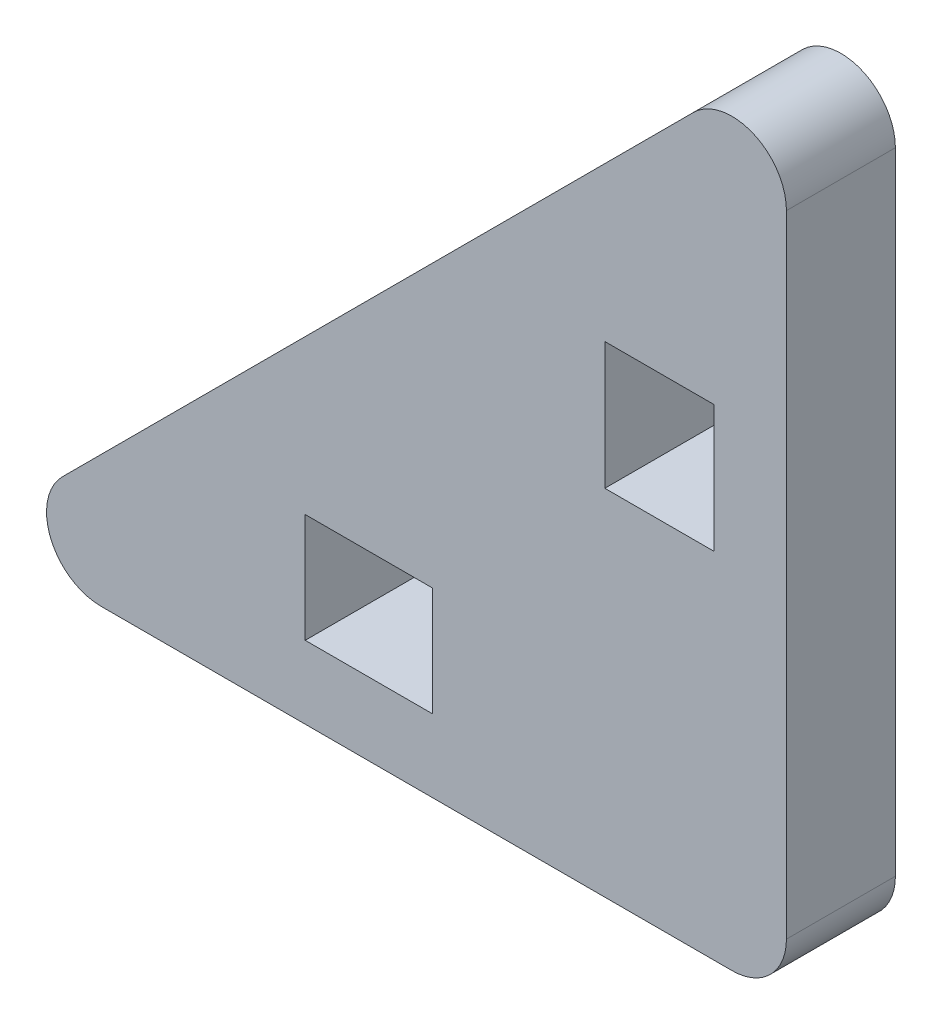
ISO-10303-21;
HEADER;
FILE_DESCRIPTION(('STEP AP214'),'2;1');
FILE_NAME('part.step','',(''),(''),'','','');
FILE_SCHEMA(('AUTOMOTIVE_DESIGN { 1 0 10303 214 1 1 1 1 }'));
ENDSEC;
DATA;
#1=APPLICATION_CONTEXT('core data for automotive mechanical design processes');
#2=APPLICATION_PROTOCOL_DEFINITION('international standard','automotive_design',2000,#1);
#3=PRODUCT_CONTEXT('',#1,'mechanical');
#4=PRODUCT('Part','Part','',(#3));
#5=PRODUCT_RELATED_PRODUCT_CATEGORY('part','',(#4));
#6=PRODUCT_DEFINITION_FORMATION('','',#4);
#7=PRODUCT_DEFINITION_CONTEXT('part definition',#1,'design');
#8=PRODUCT_DEFINITION('design','',#6,#7);
#9=PRODUCT_DEFINITION_SHAPE('','',#8);
#10=(LENGTH_UNIT() NAMED_UNIT(*) SI_UNIT(.MILLI.,.METRE.));
#11=(NAMED_UNIT(*) PLANE_ANGLE_UNIT() SI_UNIT($,.RADIAN.));
#12=(NAMED_UNIT(*) SI_UNIT($,.STERADIAN.) SOLID_ANGLE_UNIT());
#13=UNCERTAINTY_MEASURE_WITH_UNIT(LENGTH_MEASURE(1.E-05),#10,'distance_accuracy_value','');
#14=(GEOMETRIC_REPRESENTATION_CONTEXT(3) GLOBAL_UNCERTAINTY_ASSIGNED_CONTEXT((#13)) GLOBAL_UNIT_ASSIGNED_CONTEXT((#10,
#11,#12)) REPRESENTATION_CONTEXT('',''));
#15=CARTESIAN_POINT('',(0.,0.,0.));
#16=DIRECTION('',(0.,0.,1.));
#17=DIRECTION('',(1.,0.,0.));
#18=AXIS2_PLACEMENT_3D('',#15,#16,#17);
#19=CARTESIAN_POINT('',(0.,0.,3.));
#20=DIRECTION('',(1.,0.,0.));
#21=DIRECTION('',(0.,0.,-1.));
#22=AXIS2_PLACEMENT_3D('',#19,#20,#21);
#23=PLANE('',#22);
#24=DIRECTION('',(0.,-1.,0.));
#25=VECTOR('',#24,1.);
#26=CARTESIAN_POINT('',(0.,0.,3.));
#27=LINE('',#26,#25);
#28=CARTESIAN_POINT('',(0.,18.8713203435596,3.));
#29=VERTEX_POINT('',#28);
#30=CARTESIAN_POINT('',(0.,1.5,3.));
#31=VERTEX_POINT('',#30);
#32=EDGE_CURVE('E183',#29,#31,#27,.T.);
#33=ORIENTED_EDGE('',*,*,#32,.T.);
#34=DIRECTION('',(0.,0.,-1.));
#35=VECTOR('',#34,1.);
#36=CARTESIAN_POINT('',(0.,1.5,3.));
#37=LINE('',#36,#35);
#38=CARTESIAN_POINT('',(0.,1.5,0.));
#39=VERTEX_POINT('',#38);
#40=EDGE_CURVE('E235',#31,#39,#37,.T.);
#41=ORIENTED_EDGE('',*,*,#40,.T.);
#42=DIRECTION('',(0.,-1.,0.));
#43=VECTOR('',#42,1.);
#44=CARTESIAN_POINT('',(0.,0.,0.));
#45=LINE('',#44,#43);
#46=CARTESIAN_POINT('',(0.,18.8713203435596,0.));
#47=VERTEX_POINT('',#46);
#48=EDGE_CURVE('E212',#47,#39,#45,.T.);
#49=ORIENTED_EDGE('',*,*,#48,.F.);
#50=DIRECTION('',(0.,0.,-1.));
#51=VECTOR('',#50,1.);
#52=CARTESIAN_POINT('',(0.,18.8713203435596,3.));
#53=LINE('',#52,#51);
#54=EDGE_CURVE('E228',#47,#29,#53,.F.);
#55=ORIENTED_EDGE('',*,*,#54,.T.);
#56=EDGE_LOOP('',(#33,#41,#49,#55));
#57=FACE_BOUND('',#56,.T.);
#58=ADVANCED_FACE('F41',(#57),#23,.T.);
#59=CARTESIAN_POINT('',(-11.2463203435596,11.2463203435596,3.));
#60=DIRECTION('',(-0.707106781186547,0.707106781186547,0.));
#61=DIRECTION('',(-0.707106781186548,-0.707106781186548,0.));
#62=AXIS2_PLACEMENT_3D('',#59,#60,#61);
#63=PLANE('',#62);
#64=DIRECTION('',(0.707106781186548,0.707106781186548,0.));
#65=VECTOR('',#64,1.);
#66=CARTESIAN_POINT('',(-11.2463203435596,11.2463203435596,0.));
#67=LINE('',#66,#65);
#68=CARTESIAN_POINT('',(-19.9319805153395,2.56066017177982,0.));
#69=VERTEX_POINT('',#68);
#70=CARTESIAN_POINT('',(-2.56066017177982,19.9319805153395,0.));
#71=VERTEX_POINT('',#70);
#72=EDGE_CURVE('E215',#69,#71,#67,.T.);
#73=ORIENTED_EDGE('',*,*,#72,.F.);
#74=DIRECTION('',(0.,0.,-1.));
#75=VECTOR('',#74,1.);
#76=CARTESIAN_POINT('',(-19.9319805153395,2.56066017177982,3.));
#77=LINE('',#76,#75);
#78=CARTESIAN_POINT('',(-19.9319805153395,2.56066017177982,3.));
#79=VERTEX_POINT('',#78);
#80=EDGE_CURVE('E11',#69,#79,#77,.F.);
#81=ORIENTED_EDGE('',*,*,#80,.T.);
#82=DIRECTION('',(0.707106781186548,0.707106781186548,0.));
#83=VECTOR('',#82,1.);
#84=CARTESIAN_POINT('',(-11.2463203435596,11.2463203435596,3.));
#85=LINE('',#84,#83);
#86=CARTESIAN_POINT('',(-2.56066017177982,19.9319805153395,3.));
#87=VERTEX_POINT('',#86);
#88=EDGE_CURVE('E186',#79,#87,#85,.T.);
#89=ORIENTED_EDGE('',*,*,#88,.T.);
#90=DIRECTION('',(0.,0.,-1.));
#91=VECTOR('',#90,1.);
#92=CARTESIAN_POINT('',(-2.56066017177982,19.9319805153395,3.));
#93=LINE('',#92,#91);
#94=EDGE_CURVE('E49',#87,#71,#93,.T.);
#95=ORIENTED_EDGE('',*,*,#94,.T.);
#96=EDGE_LOOP('',(#73,#81,#89,#95));
#97=FACE_BOUND('',#96,.T.);
#98=ADVANCED_FACE('F255',(#97),#63,.T.);
#99=CARTESIAN_POINT('',(-2.,0.,3.));
#100=DIRECTION('',(-1.,0.,0.));
#101=DIRECTION('',(0.,0.,1.));
#102=AXIS2_PLACEMENT_3D('',#99,#100,#101);
#103=PLANE('',#102);
#104=DIRECTION('',(0.,1.,0.));
#105=VECTOR('',#104,1.);
#106=CARTESIAN_POINT('',(-2.,0.,0.));
#107=LINE('',#106,#105);
#108=CARTESIAN_POINT('',(-2.,9.75,0.));
#109=VERTEX_POINT('',#108);
#110=CARTESIAN_POINT('',(-2.,13.25,0.));
#111=VERTEX_POINT('',#110);
#112=EDGE_CURVE('E200',#109,#111,#107,.T.);
#113=ORIENTED_EDGE('',*,*,#112,.F.);
#114=DIRECTION('',(0.,0.,-1.));
#115=VECTOR('',#114,1.);
#116=CARTESIAN_POINT('',(-2.,9.75,3.));
#117=LINE('',#116,#115);
#118=CARTESIAN_POINT('',(-2.,9.75,3.));
#119=VERTEX_POINT('',#118);
#120=EDGE_CURVE('E226',#119,#109,#117,.T.);
#121=ORIENTED_EDGE('',*,*,#120,.F.);
#122=DIRECTION('',(0.,1.,0.));
#123=VECTOR('',#122,1.);
#124=CARTESIAN_POINT('',(-2.,0.,3.));
#125=LINE('',#124,#123);
#126=CARTESIAN_POINT('',(-2.,13.25,3.));
#127=VERTEX_POINT('',#126);
#128=EDGE_CURVE('E172',#119,#127,#125,.T.);
#129=ORIENTED_EDGE('',*,*,#128,.T.);
#130=DIRECTION('',(0.,0.,-1.));
#131=VECTOR('',#130,1.);
#132=CARTESIAN_POINT('',(-2.,13.25,3.));
#133=LINE('',#132,#131);
#134=EDGE_CURVE('E152',#127,#111,#133,.T.);
#135=ORIENTED_EDGE('',*,*,#134,.T.);
#136=EDGE_LOOP('',(#113,#121,#129,#135));
#137=FACE_BOUND('',#136,.T.);
#138=ADVANCED_FACE('F284',(#137),#103,.T.);
#139=CARTESIAN_POINT('',(0.,9.75,3.));
#140=DIRECTION('',(0.,1.,0.));
#141=DIRECTION('',(0.,0.,1.));
#142=AXIS2_PLACEMENT_3D('',#139,#140,#141);
#143=PLANE('',#142);
#144=DIRECTION('',(1.,0.,0.));
#145=VECTOR('',#144,1.);
#146=CARTESIAN_POINT('',(0.,9.75,0.));
#147=LINE('',#146,#145);
#148=CARTESIAN_POINT('',(-5.,9.75,0.));
#149=VERTEX_POINT('',#148);
#150=EDGE_CURVE('E203',#149,#109,#147,.T.);
#151=ORIENTED_EDGE('',*,*,#150,.F.);
#152=DIRECTION('',(0.,0.,-1.));
#153=VECTOR('',#152,1.);
#154=CARTESIAN_POINT('',(-5.,9.75,3.));
#155=LINE('',#154,#153);
#156=CARTESIAN_POINT('',(-5.,9.75,3.));
#157=VERTEX_POINT('',#156);
#158=EDGE_CURVE('E224',#157,#149,#155,.T.);
#159=ORIENTED_EDGE('',*,*,#158,.F.);
#160=DIRECTION('',(1.,0.,0.));
#161=VECTOR('',#160,1.);
#162=CARTESIAN_POINT('',(0.,9.75,3.));
#163=LINE('',#162,#161);
#164=EDGE_CURVE('E175',#157,#119,#163,.T.);
#165=ORIENTED_EDGE('',*,*,#164,.T.);
#166=ORIENTED_EDGE('',*,*,#120,.T.);
#167=EDGE_LOOP('',(#151,#159,#165,#166));
#168=FACE_BOUND('',#167,.T.);
#169=ADVANCED_FACE('F297',(#168),#143,.T.);
#170=CARTESIAN_POINT('',(-5.,0.,3.));
#171=DIRECTION('',(-1.,0.,0.));
#172=DIRECTION('',(0.,0.,1.));
#173=AXIS2_PLACEMENT_3D('',#170,#171,#172);
#174=PLANE('',#173);
#175=DIRECTION('',(0.,1.,0.));
#176=VECTOR('',#175,1.);
#177=CARTESIAN_POINT('',(-5.,0.,0.));
#178=LINE('',#177,#176);
#179=CARTESIAN_POINT('',(-5.,13.25,0.));
#180=VERTEX_POINT('',#179);
#181=EDGE_CURVE('E206',#149,#180,#178,.T.);
#182=ORIENTED_EDGE('',*,*,#181,.T.);
#183=DIRECTION('',(0.,0.,-1.));
#184=VECTOR('',#183,1.);
#185=CARTESIAN_POINT('',(-5.,13.25,3.));
#186=LINE('',#185,#184);
#187=CARTESIAN_POINT('',(-5.,13.25,3.));
#188=VERTEX_POINT('',#187);
#189=EDGE_CURVE('E221',#188,#180,#186,.T.);
#190=ORIENTED_EDGE('',*,*,#189,.F.);
#191=DIRECTION('',(0.,1.,0.));
#192=VECTOR('',#191,1.);
#193=CARTESIAN_POINT('',(-5.,0.,3.));
#194=LINE('',#193,#192);
#195=EDGE_CURVE('E178',#157,#188,#194,.T.);
#196=ORIENTED_EDGE('',*,*,#195,.F.);
#197=ORIENTED_EDGE('',*,*,#158,.T.);
#198=EDGE_LOOP('',(#182,#190,#196,#197));
#199=FACE_BOUND('',#198,.T.);
#200=ADVANCED_FACE('F294',(#199),#174,.F.);
#201=CARTESIAN_POINT('',(-9.75,0.,3.));
#202=DIRECTION('',(-1.,0.,0.));
#203=DIRECTION('',(0.,0.,1.));
#204=AXIS2_PLACEMENT_3D('',#201,#202,#203);
#205=PLANE('',#204);
#206=DIRECTION('',(0.,1.,0.));
#207=VECTOR('',#206,1.);
#208=CARTESIAN_POINT('',(-9.75,0.,0.));
#209=LINE('',#208,#207);
#210=CARTESIAN_POINT('',(-9.75,2.,0.));
#211=VERTEX_POINT('',#210);
#212=CARTESIAN_POINT('',(-9.75,5.,0.));
#213=VERTEX_POINT('',#212);
#214=EDGE_CURVE('E147',#211,#213,#209,.T.);
#215=ORIENTED_EDGE('',*,*,#214,.F.);
#216=DIRECTION('',(0.,0.,-1.));
#217=VECTOR('',#216,1.);
#218=CARTESIAN_POINT('',(-9.75,2.,3.));
#219=LINE('',#218,#217);
#220=CARTESIAN_POINT('',(-9.75,2.,3.));
#221=VERTEX_POINT('',#220);
#222=EDGE_CURVE('E142',#221,#211,#219,.T.);
#223=ORIENTED_EDGE('',*,*,#222,.F.);
#224=DIRECTION('',(0.,1.,0.));
#225=VECTOR('',#224,1.);
#226=CARTESIAN_POINT('',(-9.75,0.,3.));
#227=LINE('',#226,#225);
#228=CARTESIAN_POINT('',(-9.75,5.,3.));
#229=VERTEX_POINT('',#228);
#230=EDGE_CURVE('E145',#221,#229,#227,.T.);
#231=ORIENTED_EDGE('',*,*,#230,.T.);
#232=DIRECTION('',(0.,0.,-1.));
#233=VECTOR('',#232,1.);
#234=CARTESIAN_POINT('',(-9.75,5.,3.));
#235=LINE('',#234,#233);
#236=EDGE_CURVE('E191',#229,#213,#235,.T.);
#237=ORIENTED_EDGE('',*,*,#236,.T.);
#238=EDGE_LOOP('',(#215,#223,#231,#237));
#239=FACE_BOUND('',#238,.T.);
#240=ADVANCED_FACE('F144',(#239),#205,.T.);
#241=CARTESIAN_POINT('',(0.,2.,3.));
#242=DIRECTION('',(0.,1.,0.));
#243=DIRECTION('',(0.,0.,1.));
#244=AXIS2_PLACEMENT_3D('',#241,#242,#243);
#245=PLANE('',#244);
#246=DIRECTION('',(1.,0.,0.));
#247=VECTOR('',#246,1.);
#248=CARTESIAN_POINT('',(0.,2.,0.));
#249=LINE('',#248,#247);
#250=CARTESIAN_POINT('',(-13.25,2.,0.));
#251=VERTEX_POINT('',#250);
#252=EDGE_CURVE('E193',#251,#211,#249,.T.);
#253=ORIENTED_EDGE('',*,*,#252,.F.);
#254=DIRECTION('',(0.,0.,-1.));
#255=VECTOR('',#254,1.);
#256=CARTESIAN_POINT('',(-13.25,2.,3.));
#257=LINE('',#256,#255);
#258=CARTESIAN_POINT('',(-13.25,2.,3.));
#259=VERTEX_POINT('',#258);
#260=EDGE_CURVE('E153',#259,#251,#257,.T.);
#261=ORIENTED_EDGE('',*,*,#260,.F.);
#262=DIRECTION('',(1.,0.,0.));
#263=VECTOR('',#262,1.);
#264=CARTESIAN_POINT('',(0.,2.,3.));
#265=LINE('',#264,#263);
#266=EDGE_CURVE('E159',#259,#221,#265,.T.);
#267=ORIENTED_EDGE('',*,*,#266,.T.);
#268=ORIENTED_EDGE('',*,*,#222,.T.);
#269=EDGE_LOOP('',(#253,#261,#267,#268));
#270=FACE_BOUND('',#269,.T.);
#271=ADVANCED_FACE('F165',(#270),#245,.T.);
#272=CARTESIAN_POINT('',(-13.25,0.,3.));
#273=DIRECTION('',(-1.,0.,0.));
#274=DIRECTION('',(0.,0.,1.));
#275=AXIS2_PLACEMENT_3D('',#272,#273,#274);
#276=PLANE('',#275);
#277=DIRECTION('',(0.,1.,0.));
#278=VECTOR('',#277,1.);
#279=CARTESIAN_POINT('',(-13.25,0.,0.));
#280=LINE('',#279,#278);
#281=CARTESIAN_POINT('',(-13.25,5.,0.));
#282=VERTEX_POINT('',#281);
#283=EDGE_CURVE('E195',#251,#282,#280,.T.);
#284=ORIENTED_EDGE('',*,*,#283,.T.);
#285=DIRECTION('',(0.,0.,-1.));
#286=VECTOR('',#285,1.);
#287=CARTESIAN_POINT('',(-13.25,5.,3.));
#288=LINE('',#287,#286);
#289=CARTESIAN_POINT('',(-13.25,5.,3.));
#290=VERTEX_POINT('',#289);
#291=EDGE_CURVE('E230',#290,#282,#288,.T.);
#292=ORIENTED_EDGE('',*,*,#291,.F.);
#293=DIRECTION('',(0.,1.,0.));
#294=VECTOR('',#293,1.);
#295=CARTESIAN_POINT('',(-13.25,0.,3.));
#296=LINE('',#295,#294);
#297=EDGE_CURVE('E167',#259,#290,#296,.T.);
#298=ORIENTED_EDGE('',*,*,#297,.F.);
#299=ORIENTED_EDGE('',*,*,#260,.T.);
#300=EDGE_LOOP('',(#284,#292,#298,#299));
#301=FACE_BOUND('',#300,.T.);
#302=ADVANCED_FACE('F292',(#301),#276,.F.);
#303=CARTESIAN_POINT('',(0.,13.25,3.));
#304=DIRECTION('',(0.,1.,0.));
#305=DIRECTION('',(0.,0.,1.));
#306=AXIS2_PLACEMENT_3D('',#303,#304,#305);
#307=PLANE('',#306);
#308=DIRECTION('',(1.,0.,0.));
#309=VECTOR('',#308,1.);
#310=CARTESIAN_POINT('',(0.,13.25,0.));
#311=LINE('',#310,#309);
#312=EDGE_CURVE('E209',#180,#111,#311,.T.);
#313=ORIENTED_EDGE('',*,*,#312,.T.);
#314=ORIENTED_EDGE('',*,*,#134,.F.);
#315=DIRECTION('',(1.,0.,0.));
#316=VECTOR('',#315,1.);
#317=CARTESIAN_POINT('',(0.,13.25,3.));
#318=LINE('',#317,#316);
#319=EDGE_CURVE('E181',#188,#127,#318,.T.);
#320=ORIENTED_EDGE('',*,*,#319,.F.);
#321=ORIENTED_EDGE('',*,*,#189,.T.);
#322=EDGE_LOOP('',(#313,#314,#320,#321));
#323=FACE_BOUND('',#322,.T.);
#324=ADVANCED_FACE('F288',(#323),#307,.F.);
#325=CARTESIAN_POINT('',(0.,5.,3.));
#326=DIRECTION('',(0.,1.,0.));
#327=DIRECTION('',(0.,0.,1.));
#328=AXIS2_PLACEMENT_3D('',#325,#326,#327);
#329=PLANE('',#328);
#330=DIRECTION('',(1.,0.,0.));
#331=VECTOR('',#330,1.);
#332=CARTESIAN_POINT('',(0.,5.,0.));
#333=LINE('',#332,#331);
#334=EDGE_CURVE('E197',#282,#213,#333,.T.);
#335=ORIENTED_EDGE('',*,*,#334,.T.);
#336=ORIENTED_EDGE('',*,*,#236,.F.);
#337=DIRECTION('',(1.,0.,0.));
#338=VECTOR('',#337,1.);
#339=CARTESIAN_POINT('',(0.,5.,3.));
#340=LINE('',#339,#338);
#341=EDGE_CURVE('E161',#290,#229,#340,.T.);
#342=ORIENTED_EDGE('',*,*,#341,.F.);
#343=ORIENTED_EDGE('',*,*,#291,.T.);
#344=EDGE_LOOP('',(#335,#336,#342,#343));
#345=FACE_BOUND('',#344,.T.);
#346=ADVANCED_FACE('F291',(#345),#329,.F.);
#347=CARTESIAN_POINT('',(0.,0.,3.));
#348=DIRECTION('',(0.,-1.,0.));
#349=DIRECTION('',(0.,0.,-1.));
#350=AXIS2_PLACEMENT_3D('',#347,#348,#349);
#351=PLANE('',#350);
#352=DIRECTION('',(-1.,0.,0.));
#353=VECTOR('',#352,1.);
#354=CARTESIAN_POINT('',(0.,0.,0.));
#355=LINE('',#354,#353);
#356=CARTESIAN_POINT('',(-1.5,0.,0.));
#357=VERTEX_POINT('',#356);
#358=CARTESIAN_POINT('',(-18.8713203435596,0.,0.));
#359=VERTEX_POINT('',#358);
#360=EDGE_CURVE('E163',#357,#359,#355,.T.);
#361=ORIENTED_EDGE('',*,*,#360,.F.);
#362=DIRECTION('',(0.,0.,-1.));
#363=VECTOR('',#362,1.);
#364=CARTESIAN_POINT('',(-1.5,0.,3.));
#365=LINE('',#364,#363);
#366=CARTESIAN_POINT('',(-1.5,0.,3.));
#367=VERTEX_POINT('',#366);
#368=EDGE_CURVE('E247',#357,#367,#365,.F.);
#369=ORIENTED_EDGE('',*,*,#368,.T.);
#370=DIRECTION('',(-1.,0.,0.));
#371=VECTOR('',#370,1.);
#372=CARTESIAN_POINT('',(0.,0.,3.));
#373=LINE('',#372,#371);
#374=CARTESIAN_POINT('',(-18.8713203435596,0.,3.));
#375=VERTEX_POINT('',#374);
#376=EDGE_CURVE('E188',#367,#375,#373,.T.);
#377=ORIENTED_EDGE('',*,*,#376,.T.);
#378=DIRECTION('',(0.,0.,-1.));
#379=VECTOR('',#378,1.);
#380=CARTESIAN_POINT('',(-18.8713203435596,0.,3.));
#381=LINE('',#380,#379);
#382=EDGE_CURVE('E244',#375,#359,#381,.T.);
#383=ORIENTED_EDGE('',*,*,#382,.T.);
#384=EDGE_LOOP('',(#361,#369,#377,#383));
#385=FACE_BOUND('',#384,.T.);
#386=ADVANCED_FACE('F266',(#385),#351,.T.);
#387=CARTESIAN_POINT('',(0.,0.,3.));
#388=DIRECTION('',(0.,0.,1.));
#389=DIRECTION('',(1.,0.,0.));
#390=AXIS2_PLACEMENT_3D('',#387,#388,#389);
#391=PLANE('',#390);
#392=ORIENTED_EDGE('',*,*,#230,.F.);
#393=ORIENTED_EDGE('',*,*,#266,.F.);
#394=ORIENTED_EDGE('',*,*,#297,.T.);
#395=ORIENTED_EDGE('',*,*,#341,.T.);
#396=EDGE_LOOP('',(#392,#393,#394,#395));
#397=FACE_BOUND('',#396,.T.);
#398=ORIENTED_EDGE('',*,*,#128,.F.);
#399=ORIENTED_EDGE('',*,*,#164,.F.);
#400=ORIENTED_EDGE('',*,*,#195,.T.);
#401=ORIENTED_EDGE('',*,*,#319,.T.);
#402=EDGE_LOOP('',(#398,#399,#400,#401));
#403=FACE_BOUND('',#402,.T.);
#404=ORIENTED_EDGE('',*,*,#376,.F.);
#405=CARTESIAN_POINT('',(-1.5,1.5,3.));
#406=DIRECTION('',(0.,0.,1.));
#407=DIRECTION('',(1.,0.,0.));
#408=AXIS2_PLACEMENT_3D('',#405,#406,#407);
#409=CIRCLE('',#408,1.5);
#410=EDGE_CURVE('E252',#367,#31,#409,.T.);
#411=ORIENTED_EDGE('',*,*,#410,.T.);
#412=ORIENTED_EDGE('',*,*,#32,.F.);
#413=CARTESIAN_POINT('',(-1.5,18.8713203435596,3.));
#414=DIRECTION('',(0.,0.,1.));
#415=DIRECTION('',(1.,0.,0.));
#416=AXIS2_PLACEMENT_3D('',#413,#414,#415);
#417=CIRCLE('',#416,1.5);
#418=EDGE_CURVE('E56',#29,#87,#417,.T.);
#419=ORIENTED_EDGE('',*,*,#418,.T.);
#420=ORIENTED_EDGE('',*,*,#88,.F.);
#421=CARTESIAN_POINT('',(-18.8713203435596,1.5,3.));
#422=DIRECTION('',(0.,0.,1.));
#423=DIRECTION('',(1.,0.,0.));
#424=AXIS2_PLACEMENT_3D('',#421,#422,#423);
#425=CIRCLE('',#424,1.5);
#426=EDGE_CURVE('E250',#79,#375,#425,.T.);
#427=ORIENTED_EDGE('',*,*,#426,.T.);
#428=EDGE_LOOP('',(#404,#411,#412,#419,#420,#427));
#429=FACE_BOUND('',#428,.T.);
#430=ADVANCED_FACE('F157',(#397,#403,#429),#391,.T.);
#431=CARTESIAN_POINT('',(0.,0.,0.));
#432=DIRECTION('',(0.,0.,1.));
#433=DIRECTION('',(1.,0.,0.));
#434=AXIS2_PLACEMENT_3D('',#431,#432,#433);
#435=PLANE('',#434);
#436=ORIENTED_EDGE('',*,*,#214,.T.);
#437=ORIENTED_EDGE('',*,*,#334,.F.);
#438=ORIENTED_EDGE('',*,*,#283,.F.);
#439=ORIENTED_EDGE('',*,*,#252,.T.);
#440=EDGE_LOOP('',(#436,#437,#438,#439));
#441=FACE_BOUND('',#440,.T.);
#442=ORIENTED_EDGE('',*,*,#112,.T.);
#443=ORIENTED_EDGE('',*,*,#312,.F.);
#444=ORIENTED_EDGE('',*,*,#181,.F.);
#445=ORIENTED_EDGE('',*,*,#150,.T.);
#446=EDGE_LOOP('',(#442,#443,#444,#445));
#447=FACE_BOUND('',#446,.T.);
#448=ORIENTED_EDGE('',*,*,#48,.T.);
#449=CARTESIAN_POINT('',(-1.5,1.5,0.));
#450=DIRECTION('',(0.,0.,1.));
#451=DIRECTION('',(1.,0.,0.));
#452=AXIS2_PLACEMENT_3D('',#449,#450,#451);
#453=CIRCLE('',#452,1.5);
#454=EDGE_CURVE('E242',#39,#357,#453,.F.);
#455=ORIENTED_EDGE('',*,*,#454,.T.);
#456=ORIENTED_EDGE('',*,*,#360,.T.);
#457=CARTESIAN_POINT('',(-18.8713203435596,1.5,0.));
#458=DIRECTION('',(0.,0.,1.));
#459=DIRECTION('',(1.,0.,0.));
#460=AXIS2_PLACEMENT_3D('',#457,#458,#459);
#461=CIRCLE('',#460,1.5);
#462=EDGE_CURVE('E240',#359,#69,#461,.F.);
#463=ORIENTED_EDGE('',*,*,#462,.T.);
#464=ORIENTED_EDGE('',*,*,#72,.T.);
#465=CARTESIAN_POINT('',(-1.5,18.8713203435596,0.));
#466=DIRECTION('',(0.,0.,1.));
#467=DIRECTION('',(1.,0.,0.));
#468=AXIS2_PLACEMENT_3D('',#465,#466,#467);
#469=CIRCLE('',#468,1.5);
#470=EDGE_CURVE('E238',#71,#47,#469,.F.);
#471=ORIENTED_EDGE('',*,*,#470,.T.);
#472=EDGE_LOOP('',(#448,#455,#456,#463,#464,#471));
#473=FACE_BOUND('',#472,.T.);
#474=ADVANCED_FACE('F258',(#441,#447,#473),#435,.F.);
#475=CARTESIAN_POINT('',(-1.5,1.5,3.));
#476=DIRECTION('',(0.,0.,-1.));
#477=DIRECTION('',(-1.,0.,0.));
#478=AXIS2_PLACEMENT_3D('',#475,#476,#477);
#479=CYLINDRICAL_SURFACE('',#478,1.5);
#480=ORIENTED_EDGE('',*,*,#410,.F.);
#481=ORIENTED_EDGE('',*,*,#368,.F.);
#482=ORIENTED_EDGE('',*,*,#454,.F.);
#483=ORIENTED_EDGE('',*,*,#40,.F.);
#484=EDGE_LOOP('',(#480,#481,#482,#483));
#485=FACE_BOUND('',#484,.T.);
#486=ADVANCED_FACE('F272',(#485),#479,.T.);
#487=CARTESIAN_POINT('',(-18.8713203435596,1.5,3.));
#488=DIRECTION('',(0.,0.,-1.));
#489=DIRECTION('',(-1.,0.,0.));
#490=AXIS2_PLACEMENT_3D('',#487,#488,#489);
#491=CYLINDRICAL_SURFACE('',#490,1.5);
#492=ORIENTED_EDGE('',*,*,#426,.F.);
#493=ORIENTED_EDGE('',*,*,#80,.F.);
#494=ORIENTED_EDGE('',*,*,#462,.F.);
#495=ORIENTED_EDGE('',*,*,#382,.F.);
#496=EDGE_LOOP('',(#492,#493,#494,#495));
#497=FACE_BOUND('',#496,.T.);
#498=ADVANCED_FACE('F264',(#497),#491,.T.);
#499=CARTESIAN_POINT('',(-1.5,18.8713203435596,3.));
#500=DIRECTION('',(0.,0.,-1.));
#501=DIRECTION('',(-1.,0.,0.));
#502=AXIS2_PLACEMENT_3D('',#499,#500,#501);
#503=CYLINDRICAL_SURFACE('',#502,1.5);
#504=ORIENTED_EDGE('',*,*,#418,.F.);
#505=ORIENTED_EDGE('',*,*,#54,.F.);
#506=ORIENTED_EDGE('',*,*,#470,.F.);
#507=ORIENTED_EDGE('',*,*,#94,.F.);
#508=EDGE_LOOP('',(#504,#505,#506,#507));
#509=FACE_BOUND('',#508,.T.);
#510=ADVANCED_FACE('F43',(#509),#503,.T.);
#511=CLOSED_SHELL('',(#58,#98,#138,#169,#200,#240,#271,#302,#324,#346,#386,#430,#474,#486,#498,#510));
#512=MANIFOLD_SOLID_BREP('B2',#511);
#513=ADVANCED_BREP_SHAPE_REPRESENTATION('',(#18,#512),#14);
#514=SHAPE_DEFINITION_REPRESENTATION(#9,#513);
ENDSEC;
END-ISO-10303-21;
